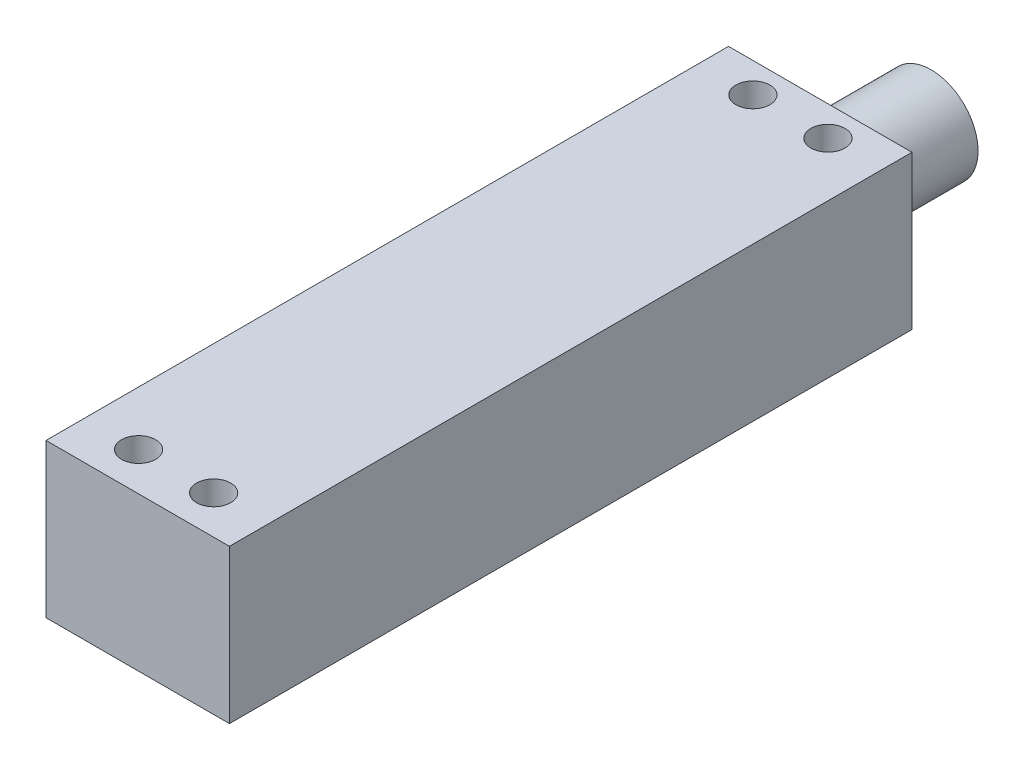
ISO-10303-21;
HEADER;
FILE_DESCRIPTION(('STEP AP214'),'2;1');
FILE_NAME('part.step','',(''),(''),'','','');
FILE_SCHEMA(('AUTOMOTIVE_DESIGN { 1 0 10303 214 1 1 1 1 }'));
ENDSEC;
DATA;
#1=APPLICATION_CONTEXT('core data for automotive mechanical design processes');
#2=APPLICATION_PROTOCOL_DEFINITION('international standard','automotive_design',2000,#1);
#3=PRODUCT_CONTEXT('',#1,'mechanical');
#4=PRODUCT('Part','Part','',(#3));
#5=PRODUCT_RELATED_PRODUCT_CATEGORY('part','',(#4));
#6=PRODUCT_DEFINITION_FORMATION('','',#4);
#7=PRODUCT_DEFINITION_CONTEXT('part definition',#1,'design');
#8=PRODUCT_DEFINITION('design','',#6,#7);
#9=PRODUCT_DEFINITION_SHAPE('','',#8);
#10=(LENGTH_UNIT() NAMED_UNIT(*) SI_UNIT(.MILLI.,.METRE.));
#11=(NAMED_UNIT(*) PLANE_ANGLE_UNIT() SI_UNIT($,.RADIAN.));
#12=(NAMED_UNIT(*) SI_UNIT($,.STERADIAN.) SOLID_ANGLE_UNIT());
#13=UNCERTAINTY_MEASURE_WITH_UNIT(LENGTH_MEASURE(1.E-05),#10,'distance_accuracy_value','');
#14=(GEOMETRIC_REPRESENTATION_CONTEXT(3) GLOBAL_UNCERTAINTY_ASSIGNED_CONTEXT((#13)) GLOBAL_UNIT_ASSIGNED_CONTEXT((#10,
#11,#12)) REPRESENTATION_CONTEXT('',''));
#15=CARTESIAN_POINT('',(0.,0.,0.));
#16=DIRECTION('',(0.,0.,1.));
#17=DIRECTION('',(1.,0.,0.));
#18=AXIS2_PLACEMENT_3D('',#15,#16,#17);
#19=CARTESIAN_POINT('',(5.50000000004047,28.,291556.));
#20=DIRECTION('',(1.,0.,0.));
#21=DIRECTION('',(0.,0.,-1.));
#22=AXIS2_PLACEMENT_3D('',#19,#20,#21);
#23=PLANE('',#22);
#24=DIRECTION('',(0.,0.,1.));
#25=VECTOR('',#24,1.);
#26=CARTESIAN_POINT('',(5.50000000004047,10.,291556.));
#27=LINE('',#26,#25);
#28=CARTESIAN_POINT('',(5.49999999998363,10.,119.399454255756));
#29=VERTEX_POINT('',#28);
#30=CARTESIAN_POINT('',(5.49999999998363,10.,199.39945425574));
#31=VERTEX_POINT('',#30);
#32=EDGE_CURVE('E112',#29,#31,#27,.T.);
#33=ORIENTED_EDGE('',*,*,#32,.F.);
#34=DIRECTION('',(0.,-1.,0.));
#35=VECTOR('',#34,1.);
#36=CARTESIAN_POINT('',(5.49999999998363,28.,119.399454255756));
#37=LINE('',#36,#35);
#38=CARTESIAN_POINT('',(5.49999999998363,28.,119.399454255756));
#39=VERTEX_POINT('',#38);
#40=EDGE_CURVE('E48',#39,#29,#37,.T.);
#41=ORIENTED_EDGE('',*,*,#40,.F.);
#42=DIRECTION('',(0.,0.,1.));
#43=VECTOR('',#42,1.);
#44=CARTESIAN_POINT('',(5.50000000004047,28.,291556.));
#45=LINE('',#44,#43);
#46=CARTESIAN_POINT('',(5.49999999998363,28.,199.39945425574));
#47=VERTEX_POINT('',#46);
#48=EDGE_CURVE('E103',#39,#47,#45,.T.);
#49=ORIENTED_EDGE('',*,*,#48,.T.);
#50=DIRECTION('',(0.,-1.,0.));
#51=VECTOR('',#50,1.);
#52=CARTESIAN_POINT('',(5.49999999998363,28.,199.39945425574));
#53=LINE('',#52,#51);
#54=EDGE_CURVE('E83',#47,#31,#53,.T.);
#55=ORIENTED_EDGE('',*,*,#54,.T.);
#56=EDGE_LOOP('',(#33,#41,#49,#55));
#57=FACE_BOUND('',#56,.T.);
#58=ADVANCED_FACE('F39',(#57),#23,.T.);
#59=CARTESIAN_POINT('',(-400000.,28.,119.399454255756));
#60=DIRECTION('',(0.,0.,-1.));
#61=DIRECTION('',(-1.,0.,0.));
#62=AXIS2_PLACEMENT_3D('',#59,#60,#61);
#63=PLANE('',#62);
#64=CARTESIAN_POINT('',(-5.25000000001796,19.,119.399454255756));
#65=DIRECTION('',(0.,0.,-1.));
#66=DIRECTION('',(-1.,0.,0.));
#67=AXIS2_PLACEMENT_3D('',#64,#65,#66);
#68=CIRCLE('',#67,5.5);
#69=CARTESIAN_POINT('',(-10.750000000018,19.,119.399454255756));
#70=VERTEX_POINT('',#69);
#71=EDGE_CURVE('E343',#70,#70,#68,.T.);
#72=ORIENTED_EDGE('',*,*,#71,.F.);
#73=EDGE_LOOP('',(#72));
#74=FACE_BOUND('',#73,.T.);
#75=DIRECTION('',(1.,0.,0.));
#76=VECTOR('',#75,1.);
#77=CARTESIAN_POINT('',(-400000.,10.,119.399454255756));
#78=LINE('',#77,#76);
#79=CARTESIAN_POINT('',(-16.0000000000196,10.,119.399454255756));
#80=VERTEX_POINT('',#79);
#81=EDGE_CURVE('E106',#80,#29,#78,.T.);
#82=ORIENTED_EDGE('',*,*,#81,.F.);
#83=DIRECTION('',(0.,-1.,0.));
#84=VECTOR('',#83,1.);
#85=CARTESIAN_POINT('',(-16.0000000000196,28.,119.399454255756));
#86=LINE('',#85,#84);
#87=CARTESIAN_POINT('',(-16.0000000000196,28.,119.399454255756));
#88=VERTEX_POINT('',#87);
#89=EDGE_CURVE('E72',#88,#80,#86,.T.);
#90=ORIENTED_EDGE('',*,*,#89,.F.);
#91=DIRECTION('',(1.,0.,0.));
#92=VECTOR('',#91,1.);
#93=CARTESIAN_POINT('',(-400000.,28.,119.399454255756));
#94=LINE('',#93,#92);
#95=EDGE_CURVE('E98',#88,#39,#94,.T.);
#96=ORIENTED_EDGE('',*,*,#95,.T.);
#97=ORIENTED_EDGE('',*,*,#40,.T.);
#98=EDGE_LOOP('',(#82,#90,#96,#97));
#99=FACE_BOUND('',#98,.T.);
#100=ADVANCED_FACE('F131',(#74,#99),#63,.T.);
#101=CARTESIAN_POINT('',(-16.0000000001332,28.,291556.));
#102=DIRECTION('',(-1.,0.,0.));
#103=DIRECTION('',(0.,0.,1.));
#104=AXIS2_PLACEMENT_3D('',#101,#102,#103);
#105=PLANE('',#104);
#106=DIRECTION('',(0.,0.,-1.));
#107=VECTOR('',#106,1.);
#108=CARTESIAN_POINT('',(-16.0000000001332,10.,291556.));
#109=LINE('',#108,#107);
#110=CARTESIAN_POINT('',(-16.0000000000322,10.,199.39945425574));
#111=VERTEX_POINT('',#110);
#112=EDGE_CURVE('E91',#111,#80,#109,.T.);
#113=ORIENTED_EDGE('',*,*,#112,.F.);
#114=DIRECTION('',(0.,-1.,0.));
#115=VECTOR('',#114,1.);
#116=CARTESIAN_POINT('',(-16.0000000000322,28.,199.39945425574));
#117=LINE('',#116,#115);
#118=CARTESIAN_POINT('',(-16.0000000000322,28.,199.39945425574));
#119=VERTEX_POINT('',#118);
#120=EDGE_CURVE('E86',#119,#111,#117,.T.);
#121=ORIENTED_EDGE('',*,*,#120,.F.);
#122=DIRECTION('',(0.,0.,-1.));
#123=VECTOR('',#122,1.);
#124=CARTESIAN_POINT('',(-16.0000000001332,28.,291556.));
#125=LINE('',#124,#123);
#126=EDGE_CURVE('E89',#119,#88,#125,.T.);
#127=ORIENTED_EDGE('',*,*,#126,.T.);
#128=ORIENTED_EDGE('',*,*,#89,.T.);
#129=EDGE_LOOP('',(#113,#121,#127,#128));
#130=FACE_BOUND('',#129,.T.);
#131=ADVANCED_FACE('F88',(#130),#105,.T.);
#132=CARTESIAN_POINT('',(-400000.,28.,199.39945425574));
#133=DIRECTION('',(0.,0.,1.));
#134=DIRECTION('',(1.,0.,0.));
#135=AXIS2_PLACEMENT_3D('',#132,#133,#134);
#136=PLANE('',#135);
#137=DIRECTION('',(-1.,0.,0.));
#138=VECTOR('',#137,1.);
#139=CARTESIAN_POINT('',(-400000.,10.,199.39945425574));
#140=LINE('',#139,#138);
#141=EDGE_CURVE('E116',#31,#111,#140,.T.);
#142=ORIENTED_EDGE('',*,*,#141,.F.);
#143=ORIENTED_EDGE('',*,*,#54,.F.);
#144=DIRECTION('',(-1.,0.,0.));
#145=VECTOR('',#144,1.);
#146=CARTESIAN_POINT('',(-400000.,28.,199.39945425574));
#147=LINE('',#146,#145);
#148=EDGE_CURVE('E97',#47,#119,#147,.T.);
#149=ORIENTED_EDGE('',*,*,#148,.T.);
#150=ORIENTED_EDGE('',*,*,#120,.T.);
#151=EDGE_LOOP('',(#142,#143,#149,#150));
#152=FACE_BOUND('',#151,.T.);
#153=ADVANCED_FACE('F101',(#152),#136,.T.);
#154=CARTESIAN_POINT('',(0.,28.,0.));
#155=DIRECTION('',(0.,-1.,0.));
#156=DIRECTION('',(0.,0.,-1.));
#157=AXIS2_PLACEMENT_3D('',#154,#155,#156);
#158=PLANE('',#157);
#159=CARTESIAN_POINT('',(-0.85000000001796,28.,122.899454255748));
#160=DIRECTION('',(0.,1.,0.));
#161=DIRECTION('',(0.,0.,1.));
#162=AXIS2_PLACEMENT_3D('',#159,#160,#161);
#163=CIRCLE('',#162,2.);
#164=CARTESIAN_POINT('',(-0.85000000001796,28.,124.899454255748));
#165=VERTEX_POINT('',#164);
#166=EDGE_CURVE('E306',#165,#165,#163,.T.);
#167=ORIENTED_EDGE('',*,*,#166,.F.);
#168=EDGE_LOOP('',(#167));
#169=FACE_BOUND('',#168,.T.);
#170=CARTESIAN_POINT('',(-9.65000000001796,28.,122.899454255748));
#171=DIRECTION('',(0.,1.,0.));
#172=DIRECTION('',(0.,0.,1.));
#173=AXIS2_PLACEMENT_3D('',#170,#171,#172);
#174=CIRCLE('',#173,2.);
#175=CARTESIAN_POINT('',(-9.65000000001796,28.,124.899454255748));
#176=VERTEX_POINT('',#175);
#177=EDGE_CURVE('E310',#176,#176,#174,.T.);
#178=ORIENTED_EDGE('',*,*,#177,.F.);
#179=EDGE_LOOP('',(#178));
#180=FACE_BOUND('',#179,.T.);
#181=CARTESIAN_POINT('',(-9.65000000001795,28.,194.899454255748));
#182=DIRECTION('',(0.,1.,0.));
#183=DIRECTION('',(0.,0.,-1.));
#184=AXIS2_PLACEMENT_3D('',#181,#182,#183);
#185=CIRCLE('',#184,2.);
#186=CARTESIAN_POINT('',(-9.65000000001795,28.,192.899454255748));
#187=VERTEX_POINT('',#186);
#188=EDGE_CURVE('E314',#187,#187,#185,.T.);
#189=ORIENTED_EDGE('',*,*,#188,.F.);
#190=EDGE_LOOP('',(#189));
#191=FACE_BOUND('',#190,.T.);
#192=CARTESIAN_POINT('',(-0.850000000017952,28.,194.899454255748));
#193=DIRECTION('',(0.,1.,0.));
#194=DIRECTION('',(0.,0.,-1.));
#195=AXIS2_PLACEMENT_3D('',#192,#193,#194);
#196=CIRCLE('',#195,2.);
#197=CARTESIAN_POINT('',(-0.850000000017952,28.,192.899454255748));
#198=VERTEX_POINT('',#197);
#199=EDGE_CURVE('E317',#198,#198,#196,.T.);
#200=ORIENTED_EDGE('',*,*,#199,.F.);
#201=EDGE_LOOP('',(#200));
#202=FACE_BOUND('',#201,.T.);
#203=ORIENTED_EDGE('',*,*,#48,.F.);
#204=ORIENTED_EDGE('',*,*,#95,.F.);
#205=ORIENTED_EDGE('',*,*,#126,.F.);
#206=ORIENTED_EDGE('',*,*,#148,.F.);
#207=EDGE_LOOP('',(#203,#204,#205,#206));
#208=FACE_BOUND('',#207,.T.);
#209=ADVANCED_FACE('F96',(#169,#180,#191,#202,#208),#158,.F.);
#210=CARTESIAN_POINT('',(0.,10.,0.));
#211=DIRECTION('',(0.,-1.,0.));
#212=DIRECTION('',(0.,0.,-1.));
#213=AXIS2_PLACEMENT_3D('',#210,#211,#212);
#214=PLANE('',#213);
#215=ORIENTED_EDGE('',*,*,#32,.T.);
#216=ORIENTED_EDGE('',*,*,#141,.T.);
#217=ORIENTED_EDGE('',*,*,#112,.T.);
#218=ORIENTED_EDGE('',*,*,#81,.T.);
#219=EDGE_LOOP('',(#215,#216,#217,#218));
#220=FACE_BOUND('',#219,.T.);
#221=ADVANCED_FACE('F130',(#220),#214,.T.);
#222=CARTESIAN_POINT('',(-0.850000000017952,24.,194.899454255748));
#223=DIRECTION('',(0.,1.,0.));
#224=DIRECTION('',(0.,0.,1.));
#225=AXIS2_PLACEMENT_3D('',#222,#223,#224);
#226=CYLINDRICAL_SURFACE('',#225,2.);
#227=CARTESIAN_POINT('',(-0.850000000017952,24.,194.899454255748));
#228=DIRECTION('',(0.,1.,0.));
#229=DIRECTION('',(0.,0.,-1.));
#230=AXIS2_PLACEMENT_3D('',#227,#228,#229);
#231=CIRCLE('',#230,2.);
#232=CARTESIAN_POINT('',(-0.850000000017952,24.,192.899454255748));
#233=VERTEX_POINT('',#232);
#234=EDGE_CURVE('E117',#233,#233,#231,.T.);
#235=ORIENTED_EDGE('',*,*,#234,.F.);
#236=EDGE_LOOP('',(#235));
#237=FACE_BOUND('',#236,.T.);
#238=ORIENTED_EDGE('',*,*,#199,.T.);
#239=EDGE_LOOP('',(#238));
#240=FACE_BOUND('',#239,.T.);
#241=ADVANCED_FACE('F192',(#237,#240),#226,.F.);
#242=CARTESIAN_POINT('',(-0.850000000017952,24.,194.899454255748));
#243=DIRECTION('',(0.,-1.,0.));
#244=DIRECTION('',(0.,0.,-1.));
#245=AXIS2_PLACEMENT_3D('',#242,#243,#244);
#246=PLANE('',#245);
#247=ORIENTED_EDGE('',*,*,#234,.T.);
#248=EDGE_LOOP('',(#247));
#249=FACE_BOUND('',#248,.T.);
#250=ADVANCED_FACE('F174',(#249),#246,.F.);
#251=CARTESIAN_POINT('',(-9.65000000001795,24.,194.899454255748));
#252=DIRECTION('',(0.,1.,0.));
#253=DIRECTION('',(0.,0.,1.));
#254=AXIS2_PLACEMENT_3D('',#251,#252,#253);
#255=CYLINDRICAL_SURFACE('',#254,2.);
#256=CARTESIAN_POINT('',(-9.65000000001795,24.,194.899454255748));
#257=DIRECTION('',(0.,1.,0.));
#258=DIRECTION('',(0.,0.,-1.));
#259=AXIS2_PLACEMENT_3D('',#256,#257,#258);
#260=CIRCLE('',#259,2.);
#261=CARTESIAN_POINT('',(-9.65000000001795,24.,192.899454255748));
#262=VERTEX_POINT('',#261);
#263=EDGE_CURVE('E320',#262,#262,#260,.T.);
#264=ORIENTED_EDGE('',*,*,#263,.F.);
#265=EDGE_LOOP('',(#264));
#266=FACE_BOUND('',#265,.T.);
#267=ORIENTED_EDGE('',*,*,#188,.T.);
#268=EDGE_LOOP('',(#267));
#269=FACE_BOUND('',#268,.T.);
#270=ADVANCED_FACE('F170',(#266,#269),#255,.F.);
#271=CARTESIAN_POINT('',(-9.65000000001795,24.,194.899454255748));
#272=DIRECTION('',(0.,-1.,0.));
#273=DIRECTION('',(0.,0.,-1.));
#274=AXIS2_PLACEMENT_3D('',#271,#272,#273);
#275=PLANE('',#274);
#276=ORIENTED_EDGE('',*,*,#263,.T.);
#277=EDGE_LOOP('',(#276));
#278=FACE_BOUND('',#277,.T.);
#279=ADVANCED_FACE('F166',(#278),#275,.F.);
#280=CARTESIAN_POINT('',(-9.65000000001796,24.,122.899454255748));
#281=DIRECTION('',(0.,1.,0.));
#282=DIRECTION('',(0.,0.,1.));
#283=AXIS2_PLACEMENT_3D('',#280,#281,#282);
#284=CYLINDRICAL_SURFACE('',#283,2.);
#285=CARTESIAN_POINT('',(-9.65000000001796,24.,122.899454255748));
#286=DIRECTION('',(0.,1.,0.));
#287=DIRECTION('',(0.,0.,1.));
#288=AXIS2_PLACEMENT_3D('',#285,#286,#287);
#289=CIRCLE('',#288,2.);
#290=CARTESIAN_POINT('',(-9.65000000001796,24.,124.899454255748));
#291=VERTEX_POINT('',#290);
#292=EDGE_CURVE('E337',#291,#291,#289,.T.);
#293=ORIENTED_EDGE('',*,*,#292,.F.);
#294=EDGE_LOOP('',(#293));
#295=FACE_BOUND('',#294,.T.);
#296=ORIENTED_EDGE('',*,*,#177,.T.);
#297=EDGE_LOOP('',(#296));
#298=FACE_BOUND('',#297,.T.);
#299=ADVANCED_FACE('F169',(#295,#298),#284,.F.);
#300=CARTESIAN_POINT('',(-9.65000000001796,24.,122.899454255748));
#301=DIRECTION('',(0.,1.,0.));
#302=DIRECTION('',(0.,0.,1.));
#303=AXIS2_PLACEMENT_3D('',#300,#301,#302);
#304=PLANE('',#303);
#305=ORIENTED_EDGE('',*,*,#292,.T.);
#306=EDGE_LOOP('',(#305));
#307=FACE_BOUND('',#306,.T.);
#308=ADVANCED_FACE('F176',(#307),#304,.T.);
#309=CARTESIAN_POINT('',(-0.85000000001796,24.,122.899454255748));
#310=DIRECTION('',(0.,1.,0.));
#311=DIRECTION('',(0.,0.,1.));
#312=AXIS2_PLACEMENT_3D('',#309,#310,#311);
#313=CYLINDRICAL_SURFACE('',#312,2.);
#314=CARTESIAN_POINT('',(-0.85000000001796,24.,122.899454255748));
#315=DIRECTION('',(0.,1.,0.));
#316=DIRECTION('',(0.,0.,1.));
#317=AXIS2_PLACEMENT_3D('',#314,#315,#316);
#318=CIRCLE('',#317,2.);
#319=CARTESIAN_POINT('',(-0.85000000001796,24.,124.899454255748));
#320=VERTEX_POINT('',#319);
#321=EDGE_CURVE('E330',#320,#320,#318,.T.);
#322=ORIENTED_EDGE('',*,*,#321,.F.);
#323=EDGE_LOOP('',(#322));
#324=FACE_BOUND('',#323,.T.);
#325=ORIENTED_EDGE('',*,*,#166,.T.);
#326=EDGE_LOOP('',(#325));
#327=FACE_BOUND('',#326,.T.);
#328=ADVANCED_FACE('F179',(#324,#327),#313,.F.);
#329=CARTESIAN_POINT('',(-0.85000000001796,24.,122.899454255748));
#330=DIRECTION('',(0.,1.,0.));
#331=DIRECTION('',(0.,0.,1.));
#332=AXIS2_PLACEMENT_3D('',#329,#330,#331);
#333=PLANE('',#332);
#334=ORIENTED_EDGE('',*,*,#321,.T.);
#335=EDGE_LOOP('',(#334));
#336=FACE_BOUND('',#335,.T.);
#337=ADVANCED_FACE('F163',(#336),#333,.T.);
#338=CARTESIAN_POINT('',(-5.25000000001796,19.,106.399454255756));
#339=DIRECTION('',(0.,0.,-1.));
#340=DIRECTION('',(-1.,0.,0.));
#341=AXIS2_PLACEMENT_3D('',#338,#339,#340);
#342=PLANE('',#341);
#343=CARTESIAN_POINT('',(-5.25000000001796,19.,106.399454255756));
#344=DIRECTION('',(0.,0.,-1.));
#345=DIRECTION('',(-1.,0.,0.));
#346=AXIS2_PLACEMENT_3D('',#343,#344,#345);
#347=CIRCLE('',#346,5.5);
#348=CARTESIAN_POINT('',(-10.750000000018,19.,106.399454255756));
#349=VERTEX_POINT('',#348);
#350=EDGE_CURVE('E331',#349,#349,#347,.T.);
#351=ORIENTED_EDGE('',*,*,#350,.T.);
#352=EDGE_LOOP('',(#351));
#353=FACE_BOUND('',#352,.T.);
#354=CARTESIAN_POINT('',(-5.25000000001796,19.,106.399454255756));
#355=DIRECTION('',(0.,0.,-1.));
#356=DIRECTION('',(-1.,0.,0.));
#357=AXIS2_PLACEMENT_3D('',#354,#355,#356);
#358=CIRCLE('',#357,4.);
#359=CARTESIAN_POINT('',(-9.25000000001796,19.,106.399454255756));
#360=VERTEX_POINT('',#359);
#361=EDGE_CURVE('E347',#360,#360,#358,.T.);
#362=ORIENTED_EDGE('',*,*,#361,.F.);
#363=EDGE_LOOP('',(#362));
#364=FACE_BOUND('',#363,.T.);
#365=ADVANCED_FACE('F157',(#353,#364),#342,.T.);
#366=CARTESIAN_POINT('',(-5.25000000001796,19.,106.399454255756));
#367=DIRECTION('',(0.,0.,1.));
#368=DIRECTION('',(1.,0.,0.));
#369=AXIS2_PLACEMENT_3D('',#366,#367,#368);
#370=CYLINDRICAL_SURFACE('',#369,5.5);
#371=ORIENTED_EDGE('',*,*,#350,.F.);
#372=EDGE_LOOP('',(#371));
#373=FACE_BOUND('',#372,.T.);
#374=ORIENTED_EDGE('',*,*,#71,.T.);
#375=EDGE_LOOP('',(#374));
#376=FACE_BOUND('',#375,.T.);
#377=ADVANCED_FACE('F149',(#373,#376),#370,.T.);
#378=CARTESIAN_POINT('',(-5.25000000001796,19.,106.399454255756));
#379=DIRECTION('',(0.,0.,1.));
#380=DIRECTION('',(1.,0.,0.));
#381=AXIS2_PLACEMENT_3D('',#378,#379,#380);
#382=CYLINDRICAL_SURFACE('',#381,4.);
#383=ORIENTED_EDGE('',*,*,#361,.T.);
#384=EDGE_LOOP('',(#383));
#385=FACE_BOUND('',#384,.T.);
#386=CARTESIAN_POINT('',(-5.25000000001796,19.,119.399454255756));
#387=DIRECTION('',(0.,0.,-1.));
#388=DIRECTION('',(-1.,0.,0.));
#389=AXIS2_PLACEMENT_3D('',#386,#387,#388);
#390=CIRCLE('',#389,4.);
#391=CARTESIAN_POINT('',(-9.25000000001796,19.,119.399454255756));
#392=VERTEX_POINT('',#391);
#393=EDGE_CURVE('E11',#392,#392,#390,.F.);
#394=ORIENTED_EDGE('',*,*,#393,.T.);
#395=EDGE_LOOP('',(#394));
#396=FACE_BOUND('',#395,.T.);
#397=ADVANCED_FACE('F144',(#385,#396),#382,.F.);
#398=ORIENTED_EDGE('',*,*,#393,.F.);
#399=EDGE_LOOP('',(#398));
#400=FACE_BOUND('',#399,.T.);
#401=ADVANCED_FACE('F135',(#400),#63,.T.);
#402=CLOSED_SHELL('',(#58,#100,#131,#153,#209,#221,#241,#250,#270,#279,#299,#308,#328,#337,#365,
#377,#397,#401));
#403=MANIFOLD_SOLID_BREP('B2',#402);
#404=ADVANCED_BREP_SHAPE_REPRESENTATION('',(#18,#403),#14);
#405=SHAPE_DEFINITION_REPRESENTATION(#9,#404);
ENDSEC;
END-ISO-10303-21;
